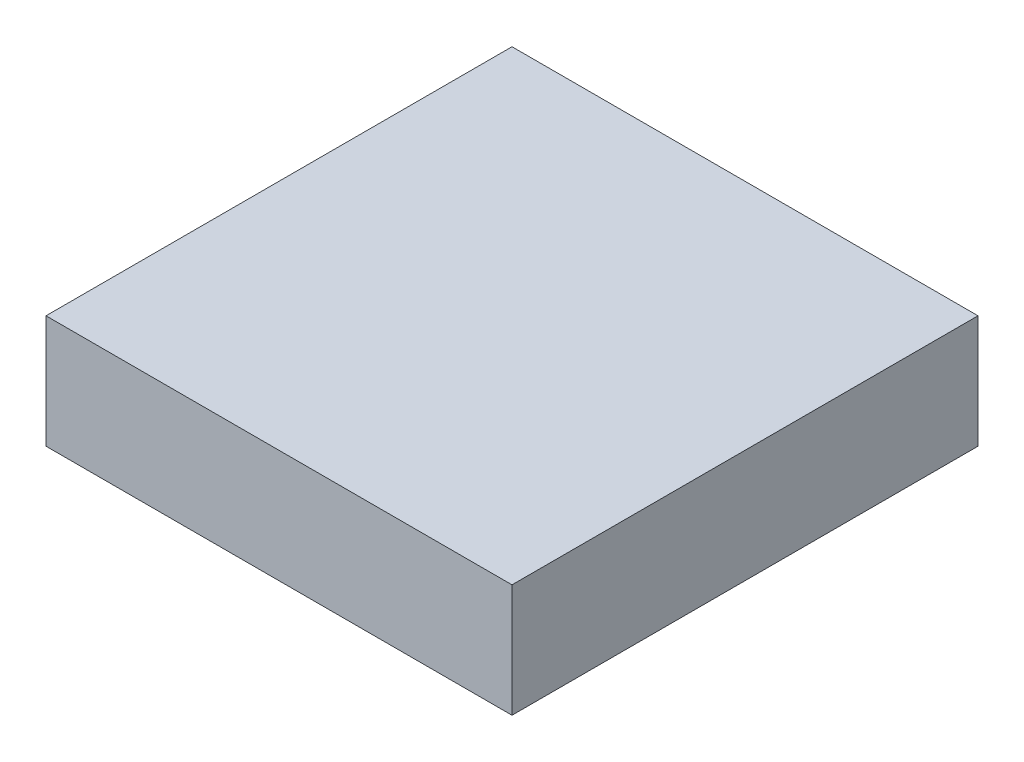
ISO-10303-21;
HEADER;
FILE_DESCRIPTION(('STEP AP214'),'2;1');
FILE_NAME('part.step','',(''),(''),'','','');
FILE_SCHEMA(('AUTOMOTIVE_DESIGN { 1 0 10303 214 1 1 1 1 }'));
ENDSEC;
DATA;
#1=APPLICATION_CONTEXT('core data for automotive mechanical design processes');
#2=APPLICATION_PROTOCOL_DEFINITION('international standard','automotive_design',2000,#1);
#3=PRODUCT_CONTEXT('',#1,'mechanical');
#4=PRODUCT('Part','Part','',(#3));
#5=PRODUCT_RELATED_PRODUCT_CATEGORY('part','',(#4));
#6=PRODUCT_DEFINITION_FORMATION('','',#4);
#7=PRODUCT_DEFINITION_CONTEXT('part definition',#1,'design');
#8=PRODUCT_DEFINITION('design','',#6,#7);
#9=PRODUCT_DEFINITION_SHAPE('','',#8);
#10=(LENGTH_UNIT() NAMED_UNIT(*) SI_UNIT(.MILLI.,.METRE.));
#11=(NAMED_UNIT(*) PLANE_ANGLE_UNIT() SI_UNIT($,.RADIAN.));
#12=(NAMED_UNIT(*) SI_UNIT($,.STERADIAN.) SOLID_ANGLE_UNIT());
#13=UNCERTAINTY_MEASURE_WITH_UNIT(LENGTH_MEASURE(1.E-05),#10,'distance_accuracy_value','');
#14=(GEOMETRIC_REPRESENTATION_CONTEXT(3) GLOBAL_UNCERTAINTY_ASSIGNED_CONTEXT((#13)) GLOBAL_UNIT_ASSIGNED_CONTEXT((#10,
#11,#12)) REPRESENTATION_CONTEXT('',''));
#15=CARTESIAN_POINT('',(0.,0.,0.));
#16=DIRECTION('',(0.,0.,1.));
#17=DIRECTION('',(1.,0.,0.));
#18=AXIS2_PLACEMENT_3D('',#15,#16,#17);
#19=CARTESIAN_POINT('',(10.4775,5.08,10.4775));
#20=DIRECTION('',(-1.,0.,0.));
#21=DIRECTION('',(0.,0.,1.));
#22=AXIS2_PLACEMENT_3D('',#19,#20,#21);
#23=PLANE('',#22);
#24=DIRECTION('',(0.,0.,-1.));
#25=VECTOR('',#24,1.);
#26=CARTESIAN_POINT('',(10.4775,0.,10.4775));
#27=LINE('',#26,#25);
#28=CARTESIAN_POINT('',(10.4775,0.,10.4775));
#29=VERTEX_POINT('',#28);
#30=CARTESIAN_POINT('',(10.4775,0.,-10.4775));
#31=VERTEX_POINT('',#30);
#32=EDGE_CURVE('E107',#29,#31,#27,.T.);
#33=ORIENTED_EDGE('',*,*,#32,.T.);
#34=DIRECTION('',(0.,-1.,0.));
#35=VECTOR('',#34,1.);
#36=CARTESIAN_POINT('',(10.4775,5.08,-10.4775));
#37=LINE('',#36,#35);
#38=CARTESIAN_POINT('',(10.4775,5.08,-10.4775));
#39=VERTEX_POINT('',#38);
#40=EDGE_CURVE('E11',#39,#31,#37,.T.);
#41=ORIENTED_EDGE('',*,*,#40,.F.);
#42=DIRECTION('',(0.,0.,-1.));
#43=VECTOR('',#42,1.);
#44=CARTESIAN_POINT('',(10.4775,5.08,10.4775));
#45=LINE('',#44,#43);
#46=CARTESIAN_POINT('',(10.4775,5.08,10.4775));
#47=VERTEX_POINT('',#46);
#48=EDGE_CURVE('E91',#47,#39,#45,.T.);
#49=ORIENTED_EDGE('',*,*,#48,.F.);
#50=DIRECTION('',(0.,-1.,0.));
#51=VECTOR('',#50,1.);
#52=CARTESIAN_POINT('',(10.4775,5.08,10.4775));
#53=LINE('',#52,#51);
#54=EDGE_CURVE('E103',#47,#29,#53,.T.);
#55=ORIENTED_EDGE('',*,*,#54,.T.);
#56=EDGE_LOOP('',(#33,#41,#49,#55));
#57=FACE_BOUND('',#56,.T.);
#58=ADVANCED_FACE('F39',(#57),#23,.F.);
#59=CARTESIAN_POINT('',(-10.4775,5.08,-10.4775));
#60=DIRECTION('',(0.,0.,1.));
#61=DIRECTION('',(1.,0.,0.));
#62=AXIS2_PLACEMENT_3D('',#59,#60,#61);
#63=PLANE('',#62);
#64=DIRECTION('',(-1.,0.,0.));
#65=VECTOR('',#64,1.);
#66=CARTESIAN_POINT('',(-10.4775,0.,-10.4775));
#67=LINE('',#66,#65);
#68=CARTESIAN_POINT('',(-10.4775,0.,-10.4775));
#69=VERTEX_POINT('',#68);
#70=EDGE_CURVE('E96',#31,#69,#67,.T.);
#71=ORIENTED_EDGE('',*,*,#70,.T.);
#72=DIRECTION('',(0.,-1.,0.));
#73=VECTOR('',#72,1.);
#74=CARTESIAN_POINT('',(-10.4775,5.08,-10.4775));
#75=LINE('',#74,#73);
#76=CARTESIAN_POINT('',(-10.4775,5.08,-10.4775));
#77=VERTEX_POINT('',#76);
#78=EDGE_CURVE('E48',#77,#69,#75,.T.);
#79=ORIENTED_EDGE('',*,*,#78,.F.);
#80=DIRECTION('',(-1.,0.,0.));
#81=VECTOR('',#80,1.);
#82=CARTESIAN_POINT('',(-10.4775,5.08,-10.4775));
#83=LINE('',#82,#81);
#84=EDGE_CURVE('E86',#39,#77,#83,.T.);
#85=ORIENTED_EDGE('',*,*,#84,.F.);
#86=ORIENTED_EDGE('',*,*,#40,.T.);
#87=EDGE_LOOP('',(#71,#79,#85,#86));
#88=FACE_BOUND('',#87,.T.);
#89=ADVANCED_FACE('F95',(#88),#63,.F.);
#90=CARTESIAN_POINT('',(-10.4775,5.08,10.4775));
#91=DIRECTION('',(1.,0.,0.));
#92=DIRECTION('',(0.,0.,-1.));
#93=AXIS2_PLACEMENT_3D('',#90,#91,#92);
#94=PLANE('',#93);
#95=DIRECTION('',(0.,0.,1.));
#96=VECTOR('',#95,1.);
#97=CARTESIAN_POINT('',(-10.4775,0.,10.4775));
#98=LINE('',#97,#96);
#99=CARTESIAN_POINT('',(-10.4775,0.,10.4775));
#100=VERTEX_POINT('',#99);
#101=EDGE_CURVE('E73',#69,#100,#98,.T.);
#102=ORIENTED_EDGE('',*,*,#101,.T.);
#103=DIRECTION('',(0.,-1.,0.));
#104=VECTOR('',#103,1.);
#105=CARTESIAN_POINT('',(-10.4775,5.08,10.4775));
#106=LINE('',#105,#104);
#107=CARTESIAN_POINT('',(-10.4775,5.08,10.4775));
#108=VERTEX_POINT('',#107);
#109=EDGE_CURVE('E98',#108,#100,#106,.T.);
#110=ORIENTED_EDGE('',*,*,#109,.F.);
#111=DIRECTION('',(0.,0.,1.));
#112=VECTOR('',#111,1.);
#113=CARTESIAN_POINT('',(-10.4775,5.08,10.4775));
#114=LINE('',#113,#112);
#115=EDGE_CURVE('E89',#77,#108,#114,.T.);
#116=ORIENTED_EDGE('',*,*,#115,.F.);
#117=ORIENTED_EDGE('',*,*,#78,.T.);
#118=EDGE_LOOP('',(#102,#110,#116,#117));
#119=FACE_BOUND('',#118,.T.);
#120=ADVANCED_FACE('F99',(#119),#94,.F.);
#121=CARTESIAN_POINT('',(-10.4775,5.08,10.4775));
#122=DIRECTION('',(0.,0.,-1.));
#123=DIRECTION('',(-1.,0.,0.));
#124=AXIS2_PLACEMENT_3D('',#121,#122,#123);
#125=PLANE('',#124);
#126=DIRECTION('',(1.,0.,0.));
#127=VECTOR('',#126,1.);
#128=CARTESIAN_POINT('',(-10.4775,0.,10.4775));
#129=LINE('',#128,#127);
#130=EDGE_CURVE('E79',#100,#29,#129,.T.);
#131=ORIENTED_EDGE('',*,*,#130,.T.);
#132=ORIENTED_EDGE('',*,*,#54,.F.);
#133=DIRECTION('',(1.,0.,0.));
#134=VECTOR('',#133,1.);
#135=CARTESIAN_POINT('',(-10.4775,5.08,10.4775));
#136=LINE('',#135,#134);
#137=EDGE_CURVE('E56',#108,#47,#136,.T.);
#138=ORIENTED_EDGE('',*,*,#137,.F.);
#139=ORIENTED_EDGE('',*,*,#109,.T.);
#140=EDGE_LOOP('',(#131,#132,#138,#139));
#141=FACE_BOUND('',#140,.T.);
#142=ADVANCED_FACE('F120',(#141),#125,.F.);
#143=CARTESIAN_POINT('',(0.,5.08,0.));
#144=DIRECTION('',(0.,-1.,0.));
#145=DIRECTION('',(0.,0.,-1.));
#146=AXIS2_PLACEMENT_3D('',#143,#144,#145);
#147=PLANE('',#146);
#148=ORIENTED_EDGE('',*,*,#48,.T.);
#149=ORIENTED_EDGE('',*,*,#84,.T.);
#150=ORIENTED_EDGE('',*,*,#115,.T.);
#151=ORIENTED_EDGE('',*,*,#137,.T.);
#152=EDGE_LOOP('',(#148,#149,#150,#151));
#153=FACE_BOUND('',#152,.T.);
#154=ADVANCED_FACE('F87',(#153),#147,.F.);
#155=CARTESIAN_POINT('',(0.,0.,0.));
#156=DIRECTION('',(0.,-1.,0.));
#157=DIRECTION('',(0.,0.,-1.));
#158=AXIS2_PLACEMENT_3D('',#155,#156,#157);
#159=PLANE('',#158);
#160=ORIENTED_EDGE('',*,*,#32,.F.);
#161=ORIENTED_EDGE('',*,*,#130,.F.);
#162=ORIENTED_EDGE('',*,*,#101,.F.);
#163=ORIENTED_EDGE('',*,*,#70,.F.);
#164=EDGE_LOOP('',(#160,#161,#162,#163));
#165=FACE_BOUND('',#164,.T.);
#166=ADVANCED_FACE('F123',(#165),#159,.T.);
#167=CLOSED_SHELL('',(#58,#89,#120,#142,#154,#166));
#168=MANIFOLD_SOLID_BREP('B2',#167);
#169=ADVANCED_BREP_SHAPE_REPRESENTATION('',(#18,#168),#14);
#170=SHAPE_DEFINITION_REPRESENTATION(#9,#169);
ENDSEC;
END-ISO-10303-21;
